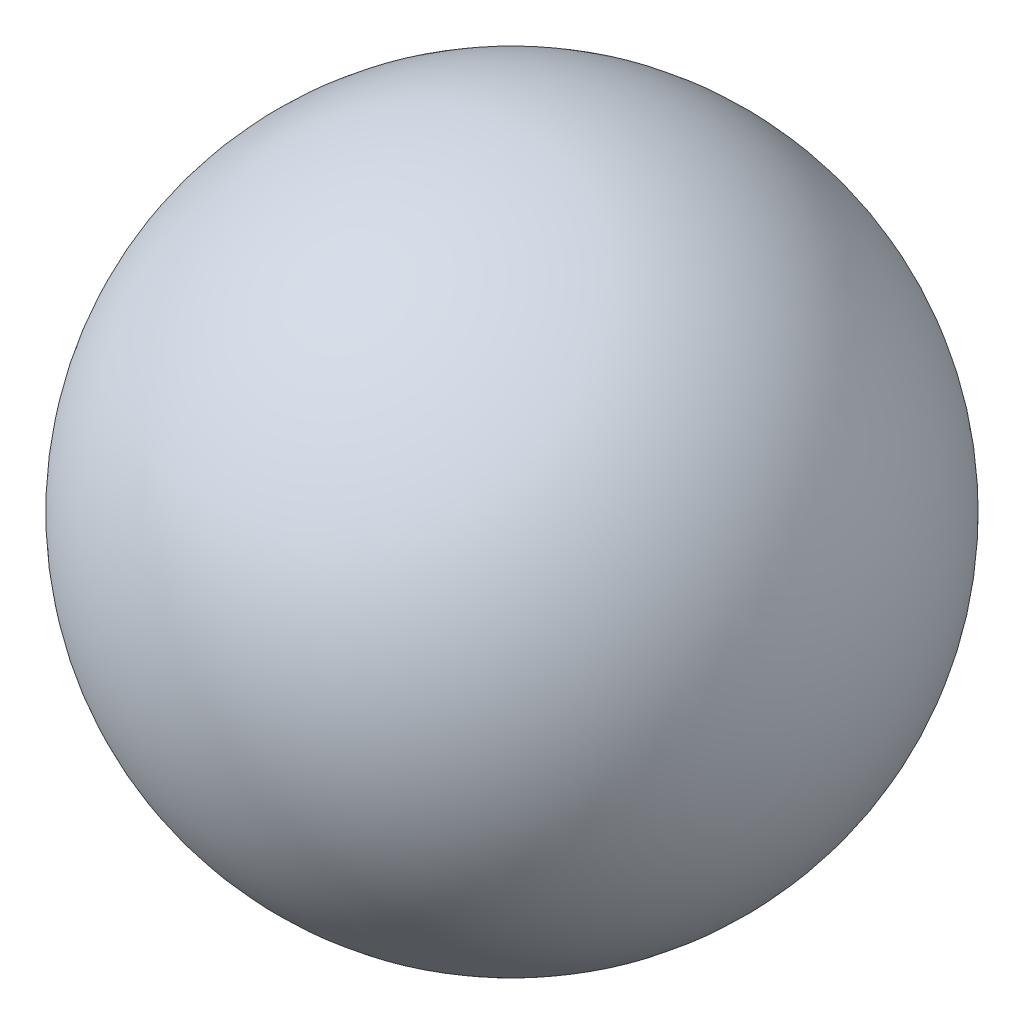
ISO-10303-21;
HEADER;
FILE_DESCRIPTION(('STEP AP214'),'2;1');
FILE_NAME('part.step','',(''),(''),'','','');
FILE_SCHEMA(('AUTOMOTIVE_DESIGN { 1 0 10303 214 1 1 1 1 }'));
ENDSEC;
DATA;
#1=APPLICATION_CONTEXT('core data for automotive mechanical design processes');
#2=APPLICATION_PROTOCOL_DEFINITION('international standard','automotive_design',2000,#1);
#3=PRODUCT_CONTEXT('',#1,'mechanical');
#4=PRODUCT('Part','Part','',(#3));
#5=PRODUCT_RELATED_PRODUCT_CATEGORY('part','',(#4));
#6=PRODUCT_DEFINITION_FORMATION('','',#4);
#7=PRODUCT_DEFINITION_CONTEXT('part definition',#1,'design');
#8=PRODUCT_DEFINITION('design','',#6,#7);
#9=PRODUCT_DEFINITION_SHAPE('','',#8);
#10=(LENGTH_UNIT() NAMED_UNIT(*) SI_UNIT(.MILLI.,.METRE.));
#11=(NAMED_UNIT(*) PLANE_ANGLE_UNIT() SI_UNIT($,.RADIAN.));
#12=(NAMED_UNIT(*) SI_UNIT($,.STERADIAN.) SOLID_ANGLE_UNIT());
#13=UNCERTAINTY_MEASURE_WITH_UNIT(LENGTH_MEASURE(1.E-05),#10,'distance_accuracy_value','');
#14=(GEOMETRIC_REPRESENTATION_CONTEXT(3) GLOBAL_UNCERTAINTY_ASSIGNED_CONTEXT((#13)) GLOBAL_UNIT_ASSIGNED_CONTEXT((#10,
#11,#12)) REPRESENTATION_CONTEXT('',''));
#15=CARTESIAN_POINT('',(0.,0.,0.));
#16=DIRECTION('',(0.,0.,1.));
#17=DIRECTION('',(1.,0.,0.));
#18=AXIS2_PLACEMENT_3D('',#15,#16,#17);
#19=CARTESIAN_POINT('',(0.,0.,0.));
#20=DIRECTION('',(0.,1.,0.));
#21=DIRECTION('',(0.,0.,-1.));
#22=AXIS2_PLACEMENT_3D('',#19,#20,#21);
#23=SPHERICAL_SURFACE('',#22,50.);
#24=CARTESIAN_POINT('',(0.,50.,0.));
#25=VERTEX_POINT('',#24);
#26=VERTEX_LOOP('',#25);
#27=FACE_BOUND('',#26,.T.);
#28=ADVANCED_FACE('F31',(#27),#23,.T.);
#29=CLOSED_SHELL('',(#28));
#30=MANIFOLD_SOLID_BREP('B2',#29);
#31=ADVANCED_BREP_SHAPE_REPRESENTATION('',(#18,#30),#14);
#32=SHAPE_DEFINITION_REPRESENTATION(#9,#31);
ENDSEC;
END-ISO-10303-21;
